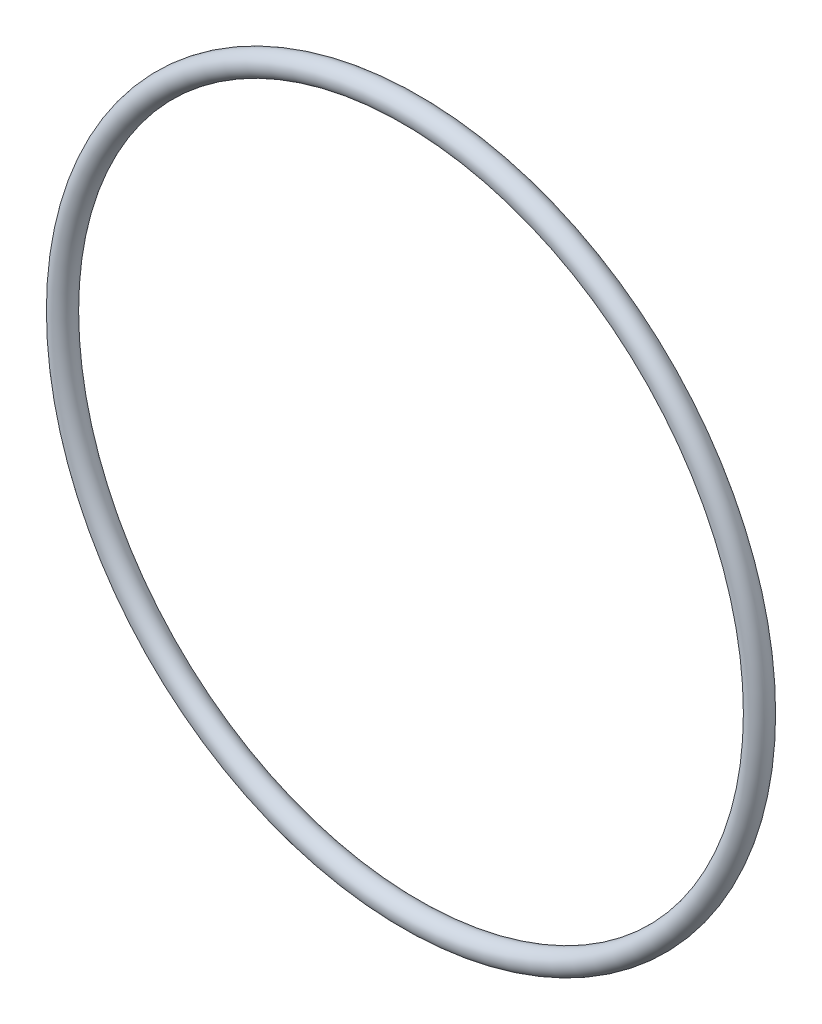
ISO-10303-21;
HEADER;
FILE_DESCRIPTION(('STEP AP214'),'2;1');
FILE_NAME('part.step','',(''),(''),'','','');
FILE_SCHEMA(('AUTOMOTIVE_DESIGN { 1 0 10303 214 1 1 1 1 }'));
ENDSEC;
DATA;
#1=APPLICATION_CONTEXT('core data for automotive mechanical design processes');
#2=APPLICATION_PROTOCOL_DEFINITION('international standard','automotive_design',2000,#1);
#3=PRODUCT_CONTEXT('',#1,'mechanical');
#4=PRODUCT('Part','Part','',(#3));
#5=PRODUCT_RELATED_PRODUCT_CATEGORY('part','',(#4));
#6=PRODUCT_DEFINITION_FORMATION('','',#4);
#7=PRODUCT_DEFINITION_CONTEXT('part definition',#1,'design');
#8=PRODUCT_DEFINITION('design','',#6,#7);
#9=PRODUCT_DEFINITION_SHAPE('','',#8);
#10=(LENGTH_UNIT() NAMED_UNIT(*) SI_UNIT(.MILLI.,.METRE.));
#11=(NAMED_UNIT(*) PLANE_ANGLE_UNIT() SI_UNIT($,.RADIAN.));
#12=(NAMED_UNIT(*) SI_UNIT($,.STERADIAN.) SOLID_ANGLE_UNIT());
#13=UNCERTAINTY_MEASURE_WITH_UNIT(LENGTH_MEASURE(1.E-05),#10,'distance_accuracy_value','');
#14=(GEOMETRIC_REPRESENTATION_CONTEXT(3) GLOBAL_UNCERTAINTY_ASSIGNED_CONTEXT((#13)) GLOBAL_UNIT_ASSIGNED_CONTEXT((#10,
#11,#12)) REPRESENTATION_CONTEXT('',''));
#15=CARTESIAN_POINT('',(0.,0.,0.));
#16=DIRECTION('',(0.,0.,1.));
#17=DIRECTION('',(1.,0.,0.));
#18=AXIS2_PLACEMENT_3D('',#15,#16,#17);
#19=CARTESIAN_POINT('',(0.,0.,0.));
#20=DIRECTION('',(0.,0.,1.));
#21=DIRECTION('',(1.,0.,0.));
#22=AXIS2_PLACEMENT_3D('',#19,#20,#21);
#23=TOROIDAL_SURFACE('',#22,53.9496,1.7653);
#24=CARTESIAN_POINT('',(55.7149,0.,0.));
#25=VERTEX_POINT('',#24);
#26=VERTEX_LOOP('',#25);
#27=FACE_BOUND('',#26,.T.);
#28=ADVANCED_FACE('F30',(#27),#23,.T.);
#29=CLOSED_SHELL('',(#28));
#30=MANIFOLD_SOLID_BREP('B2',#29);
#31=ADVANCED_BREP_SHAPE_REPRESENTATION('',(#18,#30),#14);
#32=SHAPE_DEFINITION_REPRESENTATION(#9,#31);
ENDSEC;
END-ISO-10303-21;
